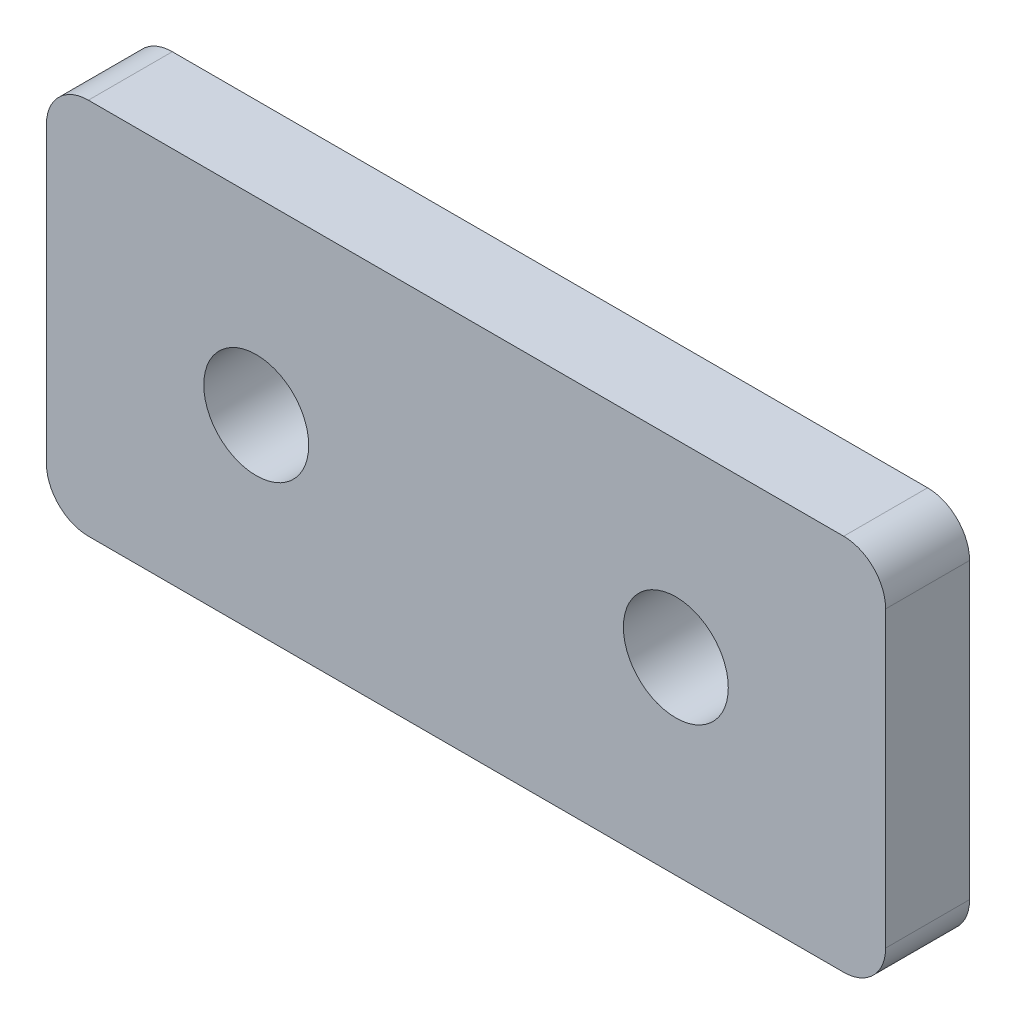
ISO-10303-21;
HEADER;
FILE_DESCRIPTION(('STEP AP214'),'2;1');
FILE_NAME('part.step','',(''),(''),'','','');
FILE_SCHEMA(('AUTOMOTIVE_DESIGN { 1 0 10303 214 1 1 1 1 }'));
ENDSEC;
DATA;
#1=APPLICATION_CONTEXT('core data for automotive mechanical design processes');
#2=APPLICATION_PROTOCOL_DEFINITION('international standard','automotive_design',2000,#1);
#3=PRODUCT_CONTEXT('',#1,'mechanical');
#4=PRODUCT('Part','Part','',(#3));
#5=PRODUCT_RELATED_PRODUCT_CATEGORY('part','',(#4));
#6=PRODUCT_DEFINITION_FORMATION('','',#4);
#7=PRODUCT_DEFINITION_CONTEXT('part definition',#1,'design');
#8=PRODUCT_DEFINITION('design','',#6,#7);
#9=PRODUCT_DEFINITION_SHAPE('','',#8);
#10=(LENGTH_UNIT() NAMED_UNIT(*) SI_UNIT(.MILLI.,.METRE.));
#11=(NAMED_UNIT(*) PLANE_ANGLE_UNIT() SI_UNIT($,.RADIAN.));
#12=(NAMED_UNIT(*) SI_UNIT($,.STERADIAN.) SOLID_ANGLE_UNIT());
#13=UNCERTAINTY_MEASURE_WITH_UNIT(LENGTH_MEASURE(1.E-05),#10,'distance_accuracy_value','');
#14=(GEOMETRIC_REPRESENTATION_CONTEXT(3) GLOBAL_UNCERTAINTY_ASSIGNED_CONTEXT((#13)) GLOBAL_UNIT_ASSIGNED_CONTEXT((#10,
#11,#12)) REPRESENTATION_CONTEXT('',''));
#15=CARTESIAN_POINT('',(0.,0.,0.));
#16=DIRECTION('',(0.,0.,1.));
#17=DIRECTION('',(1.,0.,0.));
#18=AXIS2_PLACEMENT_3D('',#15,#16,#17);
#19=CARTESIAN_POINT('',(18.438185392331,-6.07537372273691,0.637663625572713));
#20=DIRECTION('',(-1.,0.,0.));
#21=DIRECTION('',(0.,0.,1.));
#22=AXIS2_PLACEMENT_3D('',#19,#20,#21);
#23=PLANE('',#22);
#24=DIRECTION('',(0.,1.,0.));
#25=VECTOR('',#24,1.);
#26=CARTESIAN_POINT('',(18.438185392331,-6.07537372273691,-3.36233637442729));
#27=LINE('',#26,#25);
#28=CARTESIAN_POINT('',(18.438185392331,-4.07537372273691,-3.36233637442729));
#29=VERTEX_POINT('',#28);
#30=CARTESIAN_POINT('',(18.438185392331,9.92462627726309,-3.36233637442729));
#31=VERTEX_POINT('',#30);
#32=EDGE_CURVE('E109',#29,#31,#27,.T.);
#33=ORIENTED_EDGE('',*,*,#32,.T.);
#34=DIRECTION('',(0.,0.,-1.));
#35=VECTOR('',#34,1.);
#36=CARTESIAN_POINT('',(18.438185392331,9.92462627726309,0.637663625572713));
#37=LINE('',#36,#35);
#38=CARTESIAN_POINT('',(18.438185392331,9.92462627726309,0.637663625572713));
#39=VERTEX_POINT('',#38);
#40=EDGE_CURVE('E87',#31,#39,#37,.F.);
#41=ORIENTED_EDGE('',*,*,#40,.T.);
#42=DIRECTION('',(0.,1.,0.));
#43=VECTOR('',#42,1.);
#44=CARTESIAN_POINT('',(18.438185392331,-6.07537372273691,0.637663625572713));
#45=LINE('',#44,#43);
#46=CARTESIAN_POINT('',(18.438185392331,-4.07537372273691,0.637663625572713));
#47=VERTEX_POINT('',#46);
#48=EDGE_CURVE('E119',#47,#39,#45,.T.);
#49=ORIENTED_EDGE('',*,*,#48,.F.);
#50=DIRECTION('',(0.,0.,-1.));
#51=VECTOR('',#50,1.);
#52=CARTESIAN_POINT('',(18.438185392331,-4.07537372273691,0.637663625572713));
#53=LINE('',#52,#51);
#54=EDGE_CURVE('E92',#47,#29,#53,.T.);
#55=ORIENTED_EDGE('',*,*,#54,.T.);
#56=EDGE_LOOP('',(#33,#41,#49,#55));
#57=FACE_BOUND('',#56,.T.);
#58=ADVANCED_FACE('F16',(#57),#23,.F.);
#59=CARTESIAN_POINT('',(-21.561814607669,11.9246262772631,0.637663625572713));
#60=DIRECTION('',(0.,-1.,0.));
#61=DIRECTION('',(0.,0.,-1.));
#62=AXIS2_PLACEMENT_3D('',#59,#60,#61);
#63=PLANE('',#62);
#64=DIRECTION('',(-1.,0.,0.));
#65=VECTOR('',#64,1.);
#66=CARTESIAN_POINT('',(-21.561814607669,11.9246262772631,0.637663625572713));
#67=LINE('',#66,#65);
#68=CARTESIAN_POINT('',(16.438185392331,11.9246262772631,0.637663625572713));
#69=VERTEX_POINT('',#68);
#70=CARTESIAN_POINT('',(-19.561814607669,11.9246262772631,0.637663625572713));
#71=VERTEX_POINT('',#70);
#72=EDGE_CURVE('E102',#69,#71,#67,.T.);
#73=ORIENTED_EDGE('',*,*,#72,.F.);
#74=DIRECTION('',(0.,0.,-1.));
#75=VECTOR('',#74,1.);
#76=CARTESIAN_POINT('',(16.438185392331,11.9246262772631,0.637663625572713));
#77=LINE('',#76,#75);
#78=CARTESIAN_POINT('',(16.438185392331,11.9246262772631,-3.36233637442729));
#79=VERTEX_POINT('',#78);
#80=EDGE_CURVE('E86',#69,#79,#77,.T.);
#81=ORIENTED_EDGE('',*,*,#80,.T.);
#82=DIRECTION('',(-1.,0.,0.));
#83=VECTOR('',#82,1.);
#84=CARTESIAN_POINT('',(-21.561814607669,11.9246262772631,-3.36233637442729));
#85=LINE('',#84,#83);
#86=CARTESIAN_POINT('',(-19.561814607669,11.9246262772631,-3.36233637442729));
#87=VERTEX_POINT('',#86);
#88=EDGE_CURVE('E99',#79,#87,#85,.T.);
#89=ORIENTED_EDGE('',*,*,#88,.T.);
#90=DIRECTION('',(0.,0.,-1.));
#91=VECTOR('',#90,1.);
#92=CARTESIAN_POINT('',(-19.561814607669,11.9246262772631,0.637663625572713));
#93=LINE('',#92,#91);
#94=EDGE_CURVE('E104',#87,#71,#93,.F.);
#95=ORIENTED_EDGE('',*,*,#94,.T.);
#96=EDGE_LOOP('',(#73,#81,#89,#95));
#97=FACE_BOUND('',#96,.T.);
#98=ADVANCED_FACE('F98',(#97),#63,.F.);
#99=CARTESIAN_POINT('',(-21.561814607669,-6.07537372273691,0.637663625572713));
#100=DIRECTION('',(1.,0.,0.));
#101=DIRECTION('',(0.,0.,-1.));
#102=AXIS2_PLACEMENT_3D('',#99,#100,#101);
#103=PLANE('',#102);
#104=DIRECTION('',(0.,-1.,0.));
#105=VECTOR('',#104,1.);
#106=CARTESIAN_POINT('',(-21.561814607669,-6.07537372273691,-3.36233637442729));
#107=LINE('',#106,#105);
#108=CARTESIAN_POINT('',(-21.561814607669,9.92462627726309,-3.36233637442729));
#109=VERTEX_POINT('',#108);
#110=CARTESIAN_POINT('',(-21.561814607669,-4.07537372273691,-3.36233637442729));
#111=VERTEX_POINT('',#110);
#112=EDGE_CURVE('E108',#109,#111,#107,.T.);
#113=ORIENTED_EDGE('',*,*,#112,.T.);
#114=DIRECTION('',(0.,0.,-1.));
#115=VECTOR('',#114,1.);
#116=CARTESIAN_POINT('',(-21.561814607669,-4.07537372273691,0.637663625572713));
#117=LINE('',#116,#115);
#118=CARTESIAN_POINT('',(-21.561814607669,-4.07537372273691,0.637663625572713));
#119=VERTEX_POINT('',#118);
#120=EDGE_CURVE('E10',#111,#119,#117,.F.);
#121=ORIENTED_EDGE('',*,*,#120,.T.);
#122=DIRECTION('',(0.,-1.,0.));
#123=VECTOR('',#122,1.);
#124=CARTESIAN_POINT('',(-21.561814607669,-6.07537372273691,0.637663625572713));
#125=LINE('',#124,#123);
#126=CARTESIAN_POINT('',(-21.561814607669,9.92462627726309,0.637663625572713));
#127=VERTEX_POINT('',#126);
#128=EDGE_CURVE('E145',#127,#119,#125,.T.);
#129=ORIENTED_EDGE('',*,*,#128,.F.);
#130=DIRECTION('',(0.,0.,-1.));
#131=VECTOR('',#130,1.);
#132=CARTESIAN_POINT('',(-21.561814607669,9.92462627726309,0.637663625572713));
#133=LINE('',#132,#131);
#134=EDGE_CURVE('E24',#127,#109,#133,.T.);
#135=ORIENTED_EDGE('',*,*,#134,.T.);
#136=EDGE_LOOP('',(#113,#121,#129,#135));
#137=FACE_BOUND('',#136,.T.);
#138=ADVANCED_FACE('F143',(#137),#103,.F.);
#139=CARTESIAN_POINT('',(-21.561814607669,-6.07537372273691,0.637663625572713));
#140=DIRECTION('',(0.,1.,0.));
#141=DIRECTION('',(0.,0.,1.));
#142=AXIS2_PLACEMENT_3D('',#139,#140,#141);
#143=PLANE('',#142);
#144=DIRECTION('',(1.,0.,0.));
#145=VECTOR('',#144,1.);
#146=CARTESIAN_POINT('',(-21.561814607669,-6.07537372273691,-3.36233637442729));
#147=LINE('',#146,#145);
#148=CARTESIAN_POINT('',(-19.561814607669,-6.07537372273691,-3.36233637442729));
#149=VERTEX_POINT('',#148);
#150=CARTESIAN_POINT('',(16.438185392331,-6.07537372273691,-3.36233637442729));
#151=VERTEX_POINT('',#150);
#152=EDGE_CURVE('E112',#149,#151,#147,.T.);
#153=ORIENTED_EDGE('',*,*,#152,.T.);
#154=DIRECTION('',(0.,0.,-1.));
#155=VECTOR('',#154,1.);
#156=CARTESIAN_POINT('',(16.438185392331,-6.07537372273691,0.637663625572713));
#157=LINE('',#156,#155);
#158=CARTESIAN_POINT('',(16.438185392331,-6.07537372273691,0.637663625572713));
#159=VERTEX_POINT('',#158);
#160=EDGE_CURVE('E31',#151,#159,#157,.F.);
#161=ORIENTED_EDGE('',*,*,#160,.T.);
#162=DIRECTION('',(1.,0.,0.));
#163=VECTOR('',#162,1.);
#164=CARTESIAN_POINT('',(-21.561814607669,-6.07537372273691,0.637663625572713));
#165=LINE('',#164,#163);
#166=CARTESIAN_POINT('',(-19.561814607669,-6.07537372273691,0.637663625572713));
#167=VERTEX_POINT('',#166);
#168=EDGE_CURVE('E120',#167,#159,#165,.T.);
#169=ORIENTED_EDGE('',*,*,#168,.F.);
#170=DIRECTION('',(0.,0.,-1.));
#171=VECTOR('',#170,1.);
#172=CARTESIAN_POINT('',(-19.561814607669,-6.07537372273691,0.637663625572713));
#173=LINE('',#172,#171);
#174=EDGE_CURVE('E136',#167,#149,#173,.T.);
#175=ORIENTED_EDGE('',*,*,#174,.T.);
#176=EDGE_LOOP('',(#153,#161,#169,#175));
#177=FACE_BOUND('',#176,.T.);
#178=ADVANCED_FACE('F152',(#177),#143,.F.);
#179=CARTESIAN_POINT('',(-1.56181460766901,2.92462627726309,0.637663625572713));
#180=DIRECTION('',(0.,0.,-1.));
#181=DIRECTION('',(-1.,0.,0.));
#182=AXIS2_PLACEMENT_3D('',#179,#180,#181);
#183=PLANE('',#182);
#184=CARTESIAN_POINT('',(-11.561814607669,2.92462627726309,0.637663625572713));
#185=DIRECTION('',(0.,0.,-1.));
#186=DIRECTION('',(-1.,0.,0.));
#187=AXIS2_PLACEMENT_3D('',#184,#185,#186);
#188=CIRCLE('',#187,2.5);
#189=CARTESIAN_POINT('',(-14.061814607669,2.92462627726309,0.637663625572713));
#190=VERTEX_POINT('',#189);
#191=EDGE_CURVE('E114',#190,#190,#188,.T.);
#192=ORIENTED_EDGE('',*,*,#191,.T.);
#193=EDGE_LOOP('',(#192));
#194=FACE_BOUND('',#193,.T.);
#195=CARTESIAN_POINT('',(8.43818539233099,2.92462627726309,0.637663625572713));
#196=DIRECTION('',(0.,0.,-1.));
#197=DIRECTION('',(-1.,0.,0.));
#198=AXIS2_PLACEMENT_3D('',#195,#196,#197);
#199=CIRCLE('',#198,2.5);
#200=CARTESIAN_POINT('',(5.93818539233099,2.92462627726309,0.637663625572713));
#201=VERTEX_POINT('',#200);
#202=EDGE_CURVE('E161',#201,#201,#199,.T.);
#203=ORIENTED_EDGE('',*,*,#202,.T.);
#204=EDGE_LOOP('',(#203));
#205=FACE_BOUND('',#204,.T.);
#206=ORIENTED_EDGE('',*,*,#48,.T.);
#207=CARTESIAN_POINT('',(16.438185392331,9.92462627726309,0.637663625572713));
#208=DIRECTION('',(0.,0.,-1.));
#209=DIRECTION('',(-1.,0.,0.));
#210=AXIS2_PLACEMENT_3D('',#207,#208,#209);
#211=CIRCLE('',#210,2.);
#212=EDGE_CURVE('E134',#39,#69,#211,.F.);
#213=ORIENTED_EDGE('',*,*,#212,.T.);
#214=ORIENTED_EDGE('',*,*,#72,.T.);
#215=CARTESIAN_POINT('',(-19.561814607669,9.92462627726309,0.637663625572713));
#216=DIRECTION('',(0.,0.,-1.));
#217=DIRECTION('',(-1.,0.,0.));
#218=AXIS2_PLACEMENT_3D('',#215,#216,#217);
#219=CIRCLE('',#218,2.);
#220=EDGE_CURVE('E129',#71,#127,#219,.F.);
#221=ORIENTED_EDGE('',*,*,#220,.T.);
#222=ORIENTED_EDGE('',*,*,#128,.T.);
#223=CARTESIAN_POINT('',(-19.561814607669,-4.07537372273691,0.637663625572713));
#224=DIRECTION('',(0.,0.,-1.));
#225=DIRECTION('',(-1.,0.,0.));
#226=AXIS2_PLACEMENT_3D('',#223,#224,#225);
#227=CIRCLE('',#226,2.);
#228=EDGE_CURVE('E38',#119,#167,#227,.F.);
#229=ORIENTED_EDGE('',*,*,#228,.T.);
#230=ORIENTED_EDGE('',*,*,#168,.T.);
#231=CARTESIAN_POINT('',(16.438185392331,-4.07537372273691,0.637663625572713));
#232=DIRECTION('',(0.,0.,-1.));
#233=DIRECTION('',(-1.,0.,0.));
#234=AXIS2_PLACEMENT_3D('',#231,#232,#233);
#235=CIRCLE('',#234,2.);
#236=EDGE_CURVE('E132',#159,#47,#235,.F.);
#237=ORIENTED_EDGE('',*,*,#236,.T.);
#238=EDGE_LOOP('',(#206,#213,#214,#221,#222,#229,#230,#237));
#239=FACE_BOUND('',#238,.T.);
#240=ADVANCED_FACE('F180',(#194,#205,#239),#183,.F.);
#241=CARTESIAN_POINT('',(-1.56181460766901,2.92462627726309,-3.36233637442729));
#242=DIRECTION('',(0.,0.,-1.));
#243=DIRECTION('',(-1.,0.,0.));
#244=AXIS2_PLACEMENT_3D('',#241,#242,#243);
#245=PLANE('',#244);
#246=CARTESIAN_POINT('',(-11.561814607669,2.92462627726309,-3.36233637442729));
#247=DIRECTION('',(0.,0.,1.));
#248=DIRECTION('',(1.,0.,0.));
#249=AXIS2_PLACEMENT_3D('',#246,#247,#248);
#250=CIRCLE('',#249,2.5);
#251=CARTESIAN_POINT('',(-9.06181460766901,2.92462627726309,-3.36233637442729));
#252=VERTEX_POINT('',#251);
#253=EDGE_CURVE('E164',#252,#252,#250,.T.);
#254=ORIENTED_EDGE('',*,*,#253,.T.);
#255=EDGE_LOOP('',(#254));
#256=FACE_BOUND('',#255,.T.);
#257=CARTESIAN_POINT('',(8.43818539233099,2.92462627726309,-3.36233637442729));
#258=DIRECTION('',(0.,0.,1.));
#259=DIRECTION('',(1.,0.,0.));
#260=AXIS2_PLACEMENT_3D('',#257,#258,#259);
#261=CIRCLE('',#260,2.5);
#262=CARTESIAN_POINT('',(10.938185392331,2.92462627726309,-3.36233637442729));
#263=VERTEX_POINT('',#262);
#264=EDGE_CURVE('E165',#263,#263,#261,.T.);
#265=ORIENTED_EDGE('',*,*,#264,.T.);
#266=EDGE_LOOP('',(#265));
#267=FACE_BOUND('',#266,.T.);
#268=ORIENTED_EDGE('',*,*,#88,.F.);
#269=CARTESIAN_POINT('',(16.438185392331,9.92462627726309,-3.36233637442729));
#270=DIRECTION('',(0.,0.,-1.));
#271=DIRECTION('',(-1.,0.,0.));
#272=AXIS2_PLACEMENT_3D('',#269,#270,#271);
#273=CIRCLE('',#272,2.);
#274=EDGE_CURVE('E82',#79,#31,#273,.T.);
#275=ORIENTED_EDGE('',*,*,#274,.T.);
#276=ORIENTED_EDGE('',*,*,#32,.F.);
#277=CARTESIAN_POINT('',(16.438185392331,-4.07537372273691,-3.36233637442729));
#278=DIRECTION('',(0.,0.,-1.));
#279=DIRECTION('',(-1.,0.,0.));
#280=AXIS2_PLACEMENT_3D('',#277,#278,#279);
#281=CIRCLE('',#280,2.);
#282=EDGE_CURVE('E93',#29,#151,#281,.T.);
#283=ORIENTED_EDGE('',*,*,#282,.T.);
#284=ORIENTED_EDGE('',*,*,#152,.F.);
#285=CARTESIAN_POINT('',(-19.561814607669,-4.07537372273691,-3.36233637442729));
#286=DIRECTION('',(0.,0.,-1.));
#287=DIRECTION('',(-1.,0.,0.));
#288=AXIS2_PLACEMENT_3D('',#285,#286,#287);
#289=CIRCLE('',#288,2.);
#290=EDGE_CURVE('E123',#149,#111,#289,.T.);
#291=ORIENTED_EDGE('',*,*,#290,.T.);
#292=ORIENTED_EDGE('',*,*,#112,.F.);
#293=CARTESIAN_POINT('',(-19.561814607669,9.92462627726309,-3.36233637442729));
#294=DIRECTION('',(0.,0.,-1.));
#295=DIRECTION('',(-1.,0.,0.));
#296=AXIS2_PLACEMENT_3D('',#293,#294,#295);
#297=CIRCLE('',#296,2.);
#298=EDGE_CURVE('E103',#109,#87,#297,.T.);
#299=ORIENTED_EDGE('',*,*,#298,.T.);
#300=EDGE_LOOP('',(#268,#275,#276,#283,#284,#291,#292,#299));
#301=FACE_BOUND('',#300,.T.);
#302=ADVANCED_FACE('F106',(#256,#267,#301),#245,.T.);
#303=CARTESIAN_POINT('',(16.438185392331,9.92462627726309,0.637663625572713));
#304=DIRECTION('',(0.,0.,-1.));
#305=DIRECTION('',(-1.,0.,0.));
#306=AXIS2_PLACEMENT_3D('',#303,#304,#305);
#307=CYLINDRICAL_SURFACE('',#306,2.);
#308=ORIENTED_EDGE('',*,*,#212,.F.);
#309=ORIENTED_EDGE('',*,*,#40,.F.);
#310=ORIENTED_EDGE('',*,*,#274,.F.);
#311=ORIENTED_EDGE('',*,*,#80,.F.);
#312=EDGE_LOOP('',(#308,#309,#310,#311));
#313=FACE_BOUND('',#312,.T.);
#314=ADVANCED_FACE('F85',(#313),#307,.T.);
#315=CARTESIAN_POINT('',(16.438185392331,-4.07537372273691,0.637663625572713));
#316=DIRECTION('',(0.,0.,-1.));
#317=DIRECTION('',(-1.,0.,0.));
#318=AXIS2_PLACEMENT_3D('',#315,#316,#317);
#319=CYLINDRICAL_SURFACE('',#318,2.);
#320=ORIENTED_EDGE('',*,*,#236,.F.);
#321=ORIENTED_EDGE('',*,*,#160,.F.);
#322=ORIENTED_EDGE('',*,*,#282,.F.);
#323=ORIENTED_EDGE('',*,*,#54,.F.);
#324=EDGE_LOOP('',(#320,#321,#322,#323));
#325=FACE_BOUND('',#324,.T.);
#326=ADVANCED_FACE('F189',(#325),#319,.T.);
#327=CARTESIAN_POINT('',(-19.561814607669,-4.07537372273691,0.637663625572713));
#328=DIRECTION('',(0.,0.,-1.));
#329=DIRECTION('',(-1.,0.,0.));
#330=AXIS2_PLACEMENT_3D('',#327,#328,#329);
#331=CYLINDRICAL_SURFACE('',#330,2.);
#332=ORIENTED_EDGE('',*,*,#228,.F.);
#333=ORIENTED_EDGE('',*,*,#120,.F.);
#334=ORIENTED_EDGE('',*,*,#290,.F.);
#335=ORIENTED_EDGE('',*,*,#174,.F.);
#336=EDGE_LOOP('',(#332,#333,#334,#335));
#337=FACE_BOUND('',#336,.T.);
#338=ADVANCED_FACE('F151',(#337),#331,.T.);
#339=CARTESIAN_POINT('',(-19.561814607669,9.92462627726309,0.637663625572713));
#340=DIRECTION('',(0.,0.,-1.));
#341=DIRECTION('',(-1.,0.,0.));
#342=AXIS2_PLACEMENT_3D('',#339,#340,#341);
#343=CYLINDRICAL_SURFACE('',#342,2.);
#344=ORIENTED_EDGE('',*,*,#220,.F.);
#345=ORIENTED_EDGE('',*,*,#94,.F.);
#346=ORIENTED_EDGE('',*,*,#298,.F.);
#347=ORIENTED_EDGE('',*,*,#134,.F.);
#348=EDGE_LOOP('',(#344,#345,#346,#347));
#349=FACE_BOUND('',#348,.T.);
#350=ADVANCED_FACE('F18',(#349),#343,.T.);
#351=CARTESIAN_POINT('',(8.43818539233099,2.92462627726309,-3.36233637442729));
#352=DIRECTION('',(0.,0.,1.));
#353=DIRECTION('',(1.,0.,0.));
#354=AXIS2_PLACEMENT_3D('',#351,#352,#353);
#355=CYLINDRICAL_SURFACE('',#354,2.5);
#356=ORIENTED_EDGE('',*,*,#264,.F.);
#357=EDGE_LOOP('',(#356));
#358=FACE_BOUND('',#357,.T.);
#359=ORIENTED_EDGE('',*,*,#202,.F.);
#360=EDGE_LOOP('',(#359));
#361=FACE_BOUND('',#360,.T.);
#362=ADVANCED_FACE('F176',(#358,#361),#355,.F.);
#363=CARTESIAN_POINT('',(-11.561814607669,2.92462627726309,-3.36233637442729));
#364=DIRECTION('',(0.,0.,1.));
#365=DIRECTION('',(1.,0.,0.));
#366=AXIS2_PLACEMENT_3D('',#363,#364,#365);
#367=CYLINDRICAL_SURFACE('',#366,2.5);
#368=ORIENTED_EDGE('',*,*,#253,.F.);
#369=EDGE_LOOP('',(#368));
#370=FACE_BOUND('',#369,.T.);
#371=ORIENTED_EDGE('',*,*,#191,.F.);
#372=EDGE_LOOP('',(#371));
#373=FACE_BOUND('',#372,.T.);
#374=ADVANCED_FACE('F173',(#370,#373),#367,.F.);
#375=CLOSED_SHELL('',(#58,#98,#138,#178,#240,#302,#314,#326,#338,#350,#362,#374));
#376=MANIFOLD_SOLID_BREP('B1',#375);
#377=ADVANCED_BREP_SHAPE_REPRESENTATION('',(#18,#376),#14);
#378=SHAPE_DEFINITION_REPRESENTATION(#9,#377);
ENDSEC;
END-ISO-10303-21;
